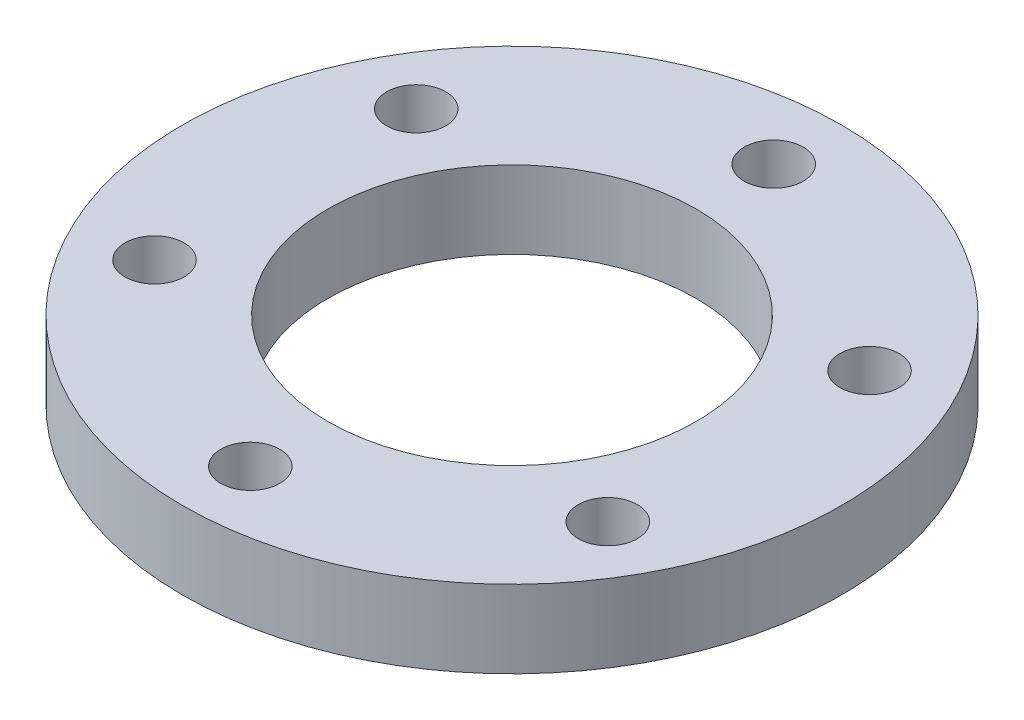
ISO-10303-21;
HEADER;
FILE_DESCRIPTION(('STEP AP214'),'2;1');
FILE_NAME('part.step','',(''),(''),'','','');
FILE_SCHEMA(('AUTOMOTIVE_DESIGN { 1 0 10303 214 1 1 1 1 }'));
ENDSEC;
DATA;
#1=APPLICATION_CONTEXT('core data for automotive mechanical design processes');
#2=APPLICATION_PROTOCOL_DEFINITION('international standard','automotive_design',2000,#1);
#3=PRODUCT_CONTEXT('',#1,'mechanical');
#4=PRODUCT('Part','Part','',(#3));
#5=PRODUCT_RELATED_PRODUCT_CATEGORY('part','',(#4));
#6=PRODUCT_DEFINITION_FORMATION('','',#4);
#7=PRODUCT_DEFINITION_CONTEXT('part definition',#1,'design');
#8=PRODUCT_DEFINITION('design','',#6,#7);
#9=PRODUCT_DEFINITION_SHAPE('','',#8);
#10=(LENGTH_UNIT() NAMED_UNIT(*) SI_UNIT(.MILLI.,.METRE.));
#11=(NAMED_UNIT(*) PLANE_ANGLE_UNIT() SI_UNIT($,.RADIAN.));
#12=(NAMED_UNIT(*) SI_UNIT($,.STERADIAN.) SOLID_ANGLE_UNIT());
#13=UNCERTAINTY_MEASURE_WITH_UNIT(LENGTH_MEASURE(1.E-05),#10,'distance_accuracy_value','');
#14=(GEOMETRIC_REPRESENTATION_CONTEXT(3) GLOBAL_UNCERTAINTY_ASSIGNED_CONTEXT((#13)) GLOBAL_UNIT_ASSIGNED_CONTEXT((#10,
#11,#12)) REPRESENTATION_CONTEXT('',''));
#15=CARTESIAN_POINT('',(0.,0.,0.));
#16=DIRECTION('',(0.,0.,1.));
#17=DIRECTION('',(1.,0.,0.));
#18=AXIS2_PLACEMENT_3D('',#15,#16,#17);
#19=CARTESIAN_POINT('',(0.,4.,0.));
#20=DIRECTION('',(0.,1.,0.));
#21=DIRECTION('',(0.,0.,1.));
#22=AXIS2_PLACEMENT_3D('',#19,#20,#21);
#23=PLANE('',#22);
#24=CARTESIAN_POINT('',(0.,4.,-13.5));
#25=DIRECTION('',(0.,1.,0.));
#26=DIRECTION('',(0.,0.,1.));
#27=AXIS2_PLACEMENT_3D('',#24,#25,#26);
#28=CIRCLE('',#27,1.525);
#29=CARTESIAN_POINT('',(0.,4.,-11.975));
#30=VERTEX_POINT('',#29);
#31=EDGE_CURVE('E67',#30,#30,#28,.T.);
#32=ORIENTED_EDGE('',*,*,#31,.F.);
#33=EDGE_LOOP('',(#32));
#34=FACE_BOUND('',#33,.T.);
#35=CARTESIAN_POINT('',(-11.6913429510899,4.,-6.74999999999999));
#36=DIRECTION('',(0.,1.,0.));
#37=DIRECTION('',(0.,0.,1.));
#38=AXIS2_PLACEMENT_3D('',#35,#36,#37);
#39=CIRCLE('',#38,1.525);
#40=CARTESIAN_POINT('',(-11.6913429510899,4.,-5.22499999999999));
#41=VERTEX_POINT('',#40);
#42=EDGE_CURVE('E101',#41,#41,#39,.T.);
#43=ORIENTED_EDGE('',*,*,#42,.F.);
#44=EDGE_LOOP('',(#43));
#45=FACE_BOUND('',#44,.T.);
#46=CARTESIAN_POINT('',(-11.6913429510899,4.,6.75000000000001));
#47=DIRECTION('',(0.,1.,0.));
#48=DIRECTION('',(0.,0.,1.));
#49=AXIS2_PLACEMENT_3D('',#46,#47,#48);
#50=CIRCLE('',#49,1.525);
#51=CARTESIAN_POINT('',(-11.6913429510899,4.,8.27500000000001));
#52=VERTEX_POINT('',#51);
#53=EDGE_CURVE('E96',#52,#52,#50,.T.);
#54=ORIENTED_EDGE('',*,*,#53,.F.);
#55=EDGE_LOOP('',(#54));
#56=FACE_BOUND('',#55,.T.);
#57=CARTESIAN_POINT('',(0.,4.,13.5));
#58=DIRECTION('',(0.,1.,0.));
#59=DIRECTION('',(0.,0.,1.));
#60=AXIS2_PLACEMENT_3D('',#57,#58,#59);
#61=CIRCLE('',#60,1.525);
#62=CARTESIAN_POINT('',(0.,4.,15.025));
#63=VERTEX_POINT('',#62);
#64=EDGE_CURVE('E100',#63,#63,#61,.T.);
#65=ORIENTED_EDGE('',*,*,#64,.F.);
#66=EDGE_LOOP('',(#65));
#67=FACE_BOUND('',#66,.T.);
#68=CARTESIAN_POINT('',(11.6913429510899,4.,6.75));
#69=DIRECTION('',(0.,1.,0.));
#70=DIRECTION('',(0.,0.,1.));
#71=AXIS2_PLACEMENT_3D('',#68,#69,#70);
#72=CIRCLE('',#71,1.525);
#73=CARTESIAN_POINT('',(11.6913429510899,4.,8.275));
#74=VERTEX_POINT('',#73);
#75=EDGE_CURVE('E105',#74,#74,#72,.T.);
#76=ORIENTED_EDGE('',*,*,#75,.F.);
#77=EDGE_LOOP('',(#76));
#78=FACE_BOUND('',#77,.T.);
#79=CARTESIAN_POINT('',(11.6913429510899,4.,-6.75));
#80=DIRECTION('',(0.,1.,0.));
#81=DIRECTION('',(0.,0.,1.));
#82=AXIS2_PLACEMENT_3D('',#79,#80,#81);
#83=CIRCLE('',#82,1.525);
#84=CARTESIAN_POINT('',(11.6913429510899,4.,-5.225));
#85=VERTEX_POINT('',#84);
#86=EDGE_CURVE('E109',#85,#85,#83,.T.);
#87=ORIENTED_EDGE('',*,*,#86,.F.);
#88=EDGE_LOOP('',(#87));
#89=FACE_BOUND('',#88,.T.);
#90=CARTESIAN_POINT('',(0.,4.,0.));
#91=DIRECTION('',(0.,1.,0.));
#92=DIRECTION('',(0.,0.,1.));
#93=AXIS2_PLACEMENT_3D('',#90,#91,#92);
#94=CIRCLE('',#93,17.);
#95=CARTESIAN_POINT('',(0.,4.,17.));
#96=VERTEX_POINT('',#95);
#97=EDGE_CURVE('E10',#96,#96,#94,.T.);
#98=ORIENTED_EDGE('',*,*,#97,.T.);
#99=EDGE_LOOP('',(#98));
#100=FACE_BOUND('',#99,.T.);
#101=CARTESIAN_POINT('',(0.,4.,0.));
#102=DIRECTION('',(0.,1.,0.));
#103=DIRECTION('',(0.,0.,1.));
#104=AXIS2_PLACEMENT_3D('',#101,#102,#103);
#105=CIRCLE('',#104,9.5);
#106=CARTESIAN_POINT('',(0.,4.,9.5));
#107=VERTEX_POINT('',#106);
#108=EDGE_CURVE('E56',#107,#107,#105,.T.);
#109=ORIENTED_EDGE('',*,*,#108,.F.);
#110=EDGE_LOOP('',(#109));
#111=FACE_BOUND('',#110,.T.);
#112=ADVANCED_FACE('F41',(#34,#45,#56,#67,#78,#89,#100,#111),#23,.T.);
#113=CARTESIAN_POINT('',(0.,0.,0.));
#114=DIRECTION('',(0.,1.,0.));
#115=DIRECTION('',(0.,0.,1.));
#116=AXIS2_PLACEMENT_3D('',#113,#114,#115);
#117=PLANE('',#116);
#118=CARTESIAN_POINT('',(0.,0.,-13.5));
#119=DIRECTION('',(0.,1.,0.));
#120=DIRECTION('',(0.,0.,1.));
#121=AXIS2_PLACEMENT_3D('',#118,#119,#120);
#122=CIRCLE('',#121,1.525);
#123=CARTESIAN_POINT('',(0.,0.,-11.975));
#124=VERTEX_POINT('',#123);
#125=EDGE_CURVE('E45',#124,#124,#122,.T.);
#126=ORIENTED_EDGE('',*,*,#125,.T.);
#127=EDGE_LOOP('',(#126));
#128=FACE_BOUND('',#127,.T.);
#129=CARTESIAN_POINT('',(-11.6913429510899,0.,-6.74999999999999));
#130=DIRECTION('',(0.,1.,0.));
#131=DIRECTION('',(0.,0.,1.));
#132=AXIS2_PLACEMENT_3D('',#129,#130,#131);
#133=CIRCLE('',#132,1.525);
#134=CARTESIAN_POINT('',(-11.6913429510899,0.,-5.22499999999999));
#135=VERTEX_POINT('',#134);
#136=EDGE_CURVE('E78',#135,#135,#133,.T.);
#137=ORIENTED_EDGE('',*,*,#136,.T.);
#138=EDGE_LOOP('',(#137));
#139=FACE_BOUND('',#138,.T.);
#140=CARTESIAN_POINT('',(-11.6913429510899,0.,6.75000000000001));
#141=DIRECTION('',(0.,1.,0.));
#142=DIRECTION('',(0.,0.,1.));
#143=AXIS2_PLACEMENT_3D('',#140,#141,#142);
#144=CIRCLE('',#143,1.525);
#145=CARTESIAN_POINT('',(-11.6913429510899,0.,8.27500000000001));
#146=VERTEX_POINT('',#145);
#147=EDGE_CURVE('E75',#146,#146,#144,.T.);
#148=ORIENTED_EDGE('',*,*,#147,.T.);
#149=EDGE_LOOP('',(#148));
#150=FACE_BOUND('',#149,.T.);
#151=CARTESIAN_POINT('',(0.,0.,13.5));
#152=DIRECTION('',(0.,1.,0.));
#153=DIRECTION('',(0.,0.,1.));
#154=AXIS2_PLACEMENT_3D('',#151,#152,#153);
#155=CIRCLE('',#154,1.525);
#156=CARTESIAN_POINT('',(0.,0.,15.025));
#157=VERTEX_POINT('',#156);
#158=EDGE_CURVE('E71',#157,#157,#155,.T.);
#159=ORIENTED_EDGE('',*,*,#158,.T.);
#160=EDGE_LOOP('',(#159));
#161=FACE_BOUND('',#160,.T.);
#162=CARTESIAN_POINT('',(11.6913429510899,0.,6.75));
#163=DIRECTION('',(0.,1.,0.));
#164=DIRECTION('',(0.,0.,1.));
#165=AXIS2_PLACEMENT_3D('',#162,#163,#164);
#166=CIRCLE('',#165,1.525);
#167=CARTESIAN_POINT('',(11.6913429510899,0.,8.275));
#168=VERTEX_POINT('',#167);
#169=EDGE_CURVE('E66',#168,#168,#166,.T.);
#170=ORIENTED_EDGE('',*,*,#169,.T.);
#171=EDGE_LOOP('',(#170));
#172=FACE_BOUND('',#171,.T.);
#173=CARTESIAN_POINT('',(11.6913429510899,0.,-6.75));
#174=DIRECTION('',(0.,1.,0.));
#175=DIRECTION('',(0.,0.,1.));
#176=AXIS2_PLACEMENT_3D('',#173,#174,#175);
#177=CIRCLE('',#176,1.525);
#178=CARTESIAN_POINT('',(11.6913429510899,0.,-5.225));
#179=VERTEX_POINT('',#178);
#180=EDGE_CURVE('E62',#179,#179,#177,.T.);
#181=ORIENTED_EDGE('',*,*,#180,.T.);
#182=EDGE_LOOP('',(#181));
#183=FACE_BOUND('',#182,.T.);
#184=CARTESIAN_POINT('',(0.,0.,0.));
#185=DIRECTION('',(0.,1.,0.));
#186=DIRECTION('',(0.,0.,1.));
#187=AXIS2_PLACEMENT_3D('',#184,#185,#186);
#188=CIRCLE('',#187,17.);
#189=CARTESIAN_POINT('',(0.,0.,17.));
#190=VERTEX_POINT('',#189);
#191=EDGE_CURVE('E50',#190,#190,#188,.T.);
#192=ORIENTED_EDGE('',*,*,#191,.F.);
#193=EDGE_LOOP('',(#192));
#194=FACE_BOUND('',#193,.T.);
#195=CARTESIAN_POINT('',(0.,0.,0.));
#196=DIRECTION('',(0.,1.,0.));
#197=DIRECTION('',(0.,0.,1.));
#198=AXIS2_PLACEMENT_3D('',#195,#196,#197);
#199=CIRCLE('',#198,9.5);
#200=CARTESIAN_POINT('',(0.,0.,9.5));
#201=VERTEX_POINT('',#200);
#202=EDGE_CURVE('E59',#201,#201,#199,.T.);
#203=ORIENTED_EDGE('',*,*,#202,.T.);
#204=EDGE_LOOP('',(#203));
#205=FACE_BOUND('',#204,.T.);
#206=ADVANCED_FACE('F125',(#128,#139,#150,#161,#172,#183,#194,#205),#117,.F.);
#207=CARTESIAN_POINT('',(0.,4.,0.));
#208=DIRECTION('',(0.,-1.,0.));
#209=DIRECTION('',(0.,0.,-1.));
#210=AXIS2_PLACEMENT_3D('',#207,#208,#209);
#211=CYLINDRICAL_SURFACE('',#210,17.);
#212=ORIENTED_EDGE('',*,*,#97,.F.);
#213=EDGE_LOOP('',(#212));
#214=FACE_BOUND('',#213,.T.);
#215=ORIENTED_EDGE('',*,*,#191,.T.);
#216=EDGE_LOOP('',(#215));
#217=FACE_BOUND('',#216,.T.);
#218=ADVANCED_FACE('F43',(#214,#217),#211,.T.);
#219=CARTESIAN_POINT('',(0.,4.,0.));
#220=DIRECTION('',(0.,-1.,0.));
#221=DIRECTION('',(0.,0.,-1.));
#222=AXIS2_PLACEMENT_3D('',#219,#220,#221);
#223=CYLINDRICAL_SURFACE('',#222,9.5);
#224=ORIENTED_EDGE('',*,*,#108,.T.);
#225=EDGE_LOOP('',(#224));
#226=FACE_BOUND('',#225,.T.);
#227=ORIENTED_EDGE('',*,*,#202,.F.);
#228=EDGE_LOOP('',(#227));
#229=FACE_BOUND('',#228,.T.);
#230=ADVANCED_FACE('F142',(#226,#229),#223,.F.);
#231=CARTESIAN_POINT('',(11.6913429510899,-96.,-6.75));
#232=DIRECTION('',(0.,1.,0.));
#233=DIRECTION('',(0.,0.,1.));
#234=AXIS2_PLACEMENT_3D('',#231,#232,#233);
#235=CYLINDRICAL_SURFACE('',#234,1.525);
#236=ORIENTED_EDGE('',*,*,#86,.T.);
#237=EDGE_LOOP('',(#236));
#238=FACE_BOUND('',#237,.T.);
#239=ORIENTED_EDGE('',*,*,#180,.F.);
#240=EDGE_LOOP('',(#239));
#241=FACE_BOUND('',#240,.T.);
#242=ADVANCED_FACE('F138',(#238,#241),#235,.F.);
#243=CARTESIAN_POINT('',(11.6913429510899,-96.,6.75));
#244=DIRECTION('',(0.,1.,0.));
#245=DIRECTION('',(0.,0.,1.));
#246=AXIS2_PLACEMENT_3D('',#243,#244,#245);
#247=CYLINDRICAL_SURFACE('',#246,1.525);
#248=ORIENTED_EDGE('',*,*,#75,.T.);
#249=EDGE_LOOP('',(#248));
#250=FACE_BOUND('',#249,.T.);
#251=ORIENTED_EDGE('',*,*,#169,.F.);
#252=EDGE_LOOP('',(#251));
#253=FACE_BOUND('',#252,.T.);
#254=ADVANCED_FACE('F141',(#250,#253),#247,.F.);
#255=CARTESIAN_POINT('',(0.,-96.,13.5));
#256=DIRECTION('',(0.,1.,0.));
#257=DIRECTION('',(0.,0.,1.));
#258=AXIS2_PLACEMENT_3D('',#255,#256,#257);
#259=CYLINDRICAL_SURFACE('',#258,1.525);
#260=ORIENTED_EDGE('',*,*,#64,.T.);
#261=EDGE_LOOP('',(#260));
#262=FACE_BOUND('',#261,.T.);
#263=ORIENTED_EDGE('',*,*,#158,.F.);
#264=EDGE_LOOP('',(#263));
#265=FACE_BOUND('',#264,.T.);
#266=ADVANCED_FACE('F164',(#262,#265),#259,.F.);
#267=CARTESIAN_POINT('',(-11.6913429510899,-96.,6.75000000000001));
#268=DIRECTION('',(0.,1.,0.));
#269=DIRECTION('',(0.,0.,1.));
#270=AXIS2_PLACEMENT_3D('',#267,#268,#269);
#271=CYLINDRICAL_SURFACE('',#270,1.525);
#272=ORIENTED_EDGE('',*,*,#53,.T.);
#273=EDGE_LOOP('',(#272));
#274=FACE_BOUND('',#273,.T.);
#275=ORIENTED_EDGE('',*,*,#147,.F.);
#276=EDGE_LOOP('',(#275));
#277=FACE_BOUND('',#276,.T.);
#278=ADVANCED_FACE('F160',(#274,#277),#271,.F.);
#279=CARTESIAN_POINT('',(-11.6913429510899,-96.,-6.74999999999999));
#280=DIRECTION('',(0.,1.,0.));
#281=DIRECTION('',(0.,0.,1.));
#282=AXIS2_PLACEMENT_3D('',#279,#280,#281);
#283=CYLINDRICAL_SURFACE('',#282,1.525);
#284=ORIENTED_EDGE('',*,*,#42,.T.);
#285=EDGE_LOOP('',(#284));
#286=FACE_BOUND('',#285,.T.);
#287=ORIENTED_EDGE('',*,*,#136,.F.);
#288=EDGE_LOOP('',(#287));
#289=FACE_BOUND('',#288,.T.);
#290=ADVANCED_FACE('F163',(#286,#289),#283,.F.);
#291=CARTESIAN_POINT('',(0.,-96.,-13.5));
#292=DIRECTION('',(0.,1.,0.));
#293=DIRECTION('',(0.,0.,1.));
#294=AXIS2_PLACEMENT_3D('',#291,#292,#293);
#295=CYLINDRICAL_SURFACE('',#294,1.525);
#296=ORIENTED_EDGE('',*,*,#31,.T.);
#297=EDGE_LOOP('',(#296));
#298=FACE_BOUND('',#297,.T.);
#299=ORIENTED_EDGE('',*,*,#125,.F.);
#300=EDGE_LOOP('',(#299));
#301=FACE_BOUND('',#300,.T.);
#302=ADVANCED_FACE('F120',(#298,#301),#295,.F.);
#303=CLOSED_SHELL('',(#112,#206,#218,#230,#242,#254,#266,#278,#290,#302));
#304=MANIFOLD_SOLID_BREP('B2',#303);
#305=ADVANCED_BREP_SHAPE_REPRESENTATION('',(#18,#304),#14);
#306=SHAPE_DEFINITION_REPRESENTATION(#9,#305);
ENDSEC;
END-ISO-10303-21;
